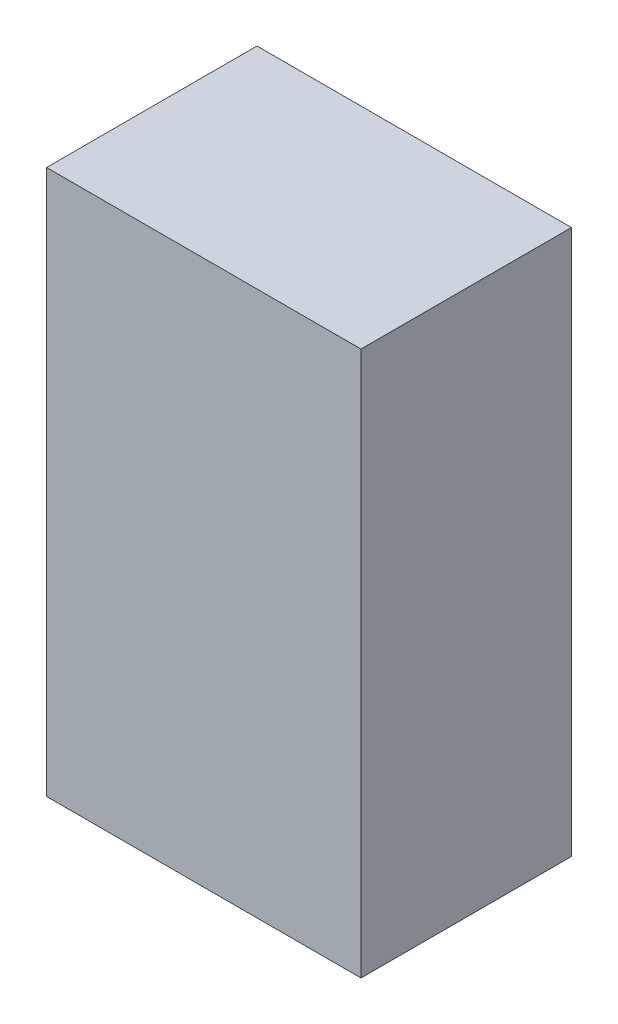
ISO-10303-21;
HEADER;
FILE_DESCRIPTION(('STEP AP214'),'2;1');
FILE_NAME('part.step','',(''),(''),'','','');
FILE_SCHEMA(('AUTOMOTIVE_DESIGN { 1 0 10303 214 1 1 1 1 }'));
ENDSEC;
DATA;
#1=APPLICATION_CONTEXT('core data for automotive mechanical design processes');
#2=APPLICATION_PROTOCOL_DEFINITION('international standard','automotive_design',2000,#1);
#3=PRODUCT_CONTEXT('',#1,'mechanical');
#4=PRODUCT('Part','Part','',(#3));
#5=PRODUCT_RELATED_PRODUCT_CATEGORY('part','',(#4));
#6=PRODUCT_DEFINITION_FORMATION('','',#4);
#7=PRODUCT_DEFINITION_CONTEXT('part definition',#1,'design');
#8=PRODUCT_DEFINITION('design','',#6,#7);
#9=PRODUCT_DEFINITION_SHAPE('','',#8);
#10=(LENGTH_UNIT() NAMED_UNIT(*) SI_UNIT(.MILLI.,.METRE.));
#11=(NAMED_UNIT(*) PLANE_ANGLE_UNIT() SI_UNIT($,.RADIAN.));
#12=(NAMED_UNIT(*) SI_UNIT($,.STERADIAN.) SOLID_ANGLE_UNIT());
#13=UNCERTAINTY_MEASURE_WITH_UNIT(LENGTH_MEASURE(1.E-05),#10,'distance_accuracy_value','');
#14=(GEOMETRIC_REPRESENTATION_CONTEXT(3) GLOBAL_UNCERTAINTY_ASSIGNED_CONTEXT((#13)) GLOBAL_UNIT_ASSIGNED_CONTEXT((#10,
#11,#12)) REPRESENTATION_CONTEXT('',''));
#15=CARTESIAN_POINT('',(0.,0.,0.));
#16=DIRECTION('',(0.,0.,1.));
#17=DIRECTION('',(1.,0.,0.));
#18=AXIS2_PLACEMENT_3D('',#15,#16,#17);
#19=CARTESIAN_POINT('',(-0.635,1.10000034,0.85000084));
#20=DIRECTION('',(0.,0.,1.));
#21=DIRECTION('',(1.,0.,0.));
#22=AXIS2_PLACEMENT_3D('',#19,#20,#21);
#23=PLANE('',#22);
#24=DIRECTION('',(0.,1.,0.));
#25=VECTOR('',#24,1.);
#26=CARTESIAN_POINT('',(0.635,1.10000034,0.85000084));
#27=LINE('',#26,#25);
#28=CARTESIAN_POINT('',(0.635,1.10000034,0.85000084));
#29=VERTEX_POINT('',#28);
#30=CARTESIAN_POINT('',(0.635,-1.10000034,0.85000084));
#31=VERTEX_POINT('',#30);
#32=EDGE_CURVE('E53',#29,#31,#27,.F.);
#33=ORIENTED_EDGE('',*,*,#32,.F.);
#34=DIRECTION('',(1.,0.,0.));
#35=VECTOR('',#34,1.);
#36=CARTESIAN_POINT('',(-0.635,1.10000034,0.85000084));
#37=LINE('',#36,#35);
#38=CARTESIAN_POINT('',(-0.635,1.10000034,0.85000084));
#39=VERTEX_POINT('',#38);
#40=EDGE_CURVE('E20',#29,#39,#37,.F.);
#41=ORIENTED_EDGE('',*,*,#40,.T.);
#42=DIRECTION('',(0.,1.,0.));
#43=VECTOR('',#42,1.);
#44=CARTESIAN_POINT('',(-0.635,-1.10000034,0.85000084));
#45=LINE('',#44,#43);
#46=CARTESIAN_POINT('',(-0.635,-1.10000034,0.85000084));
#47=VERTEX_POINT('',#46);
#48=EDGE_CURVE('E67',#47,#39,#45,.T.);
#49=ORIENTED_EDGE('',*,*,#48,.F.);
#50=DIRECTION('',(1.,0.,0.));
#51=VECTOR('',#50,1.);
#52=CARTESIAN_POINT('',(0.635,-1.10000034,0.85000084));
#53=LINE('',#52,#51);
#54=EDGE_CURVE('E58',#31,#47,#53,.F.);
#55=ORIENTED_EDGE('',*,*,#54,.F.);
#56=EDGE_LOOP('',(#33,#41,#49,#55));
#57=FACE_BOUND('',#56,.T.);
#58=ADVANCED_FACE('F17',(#57),#23,.T.);
#59=CARTESIAN_POINT('',(-0.635,-1.10000034,0.));
#60=DIRECTION('',(-1.,0.,0.));
#61=DIRECTION('',(0.,0.,1.));
#62=AXIS2_PLACEMENT_3D('',#59,#60,#61);
#63=PLANE('',#62);
#64=DIRECTION('',(0.,0.,1.));
#65=VECTOR('',#64,1.);
#66=CARTESIAN_POINT('',(-0.635,1.10000034,0.));
#67=LINE('',#66,#65);
#68=CARTESIAN_POINT('',(-0.635,1.10000034,0.));
#69=VERTEX_POINT('',#68);
#70=EDGE_CURVE('E80',#69,#39,#67,.T.);
#71=ORIENTED_EDGE('',*,*,#70,.F.);
#72=DIRECTION('',(0.,1.,0.));
#73=VECTOR('',#72,1.);
#74=CARTESIAN_POINT('',(-0.635,1.10000034,0.));
#75=LINE('',#74,#73);
#76=CARTESIAN_POINT('',(-0.635,-1.10000034,0.));
#77=VERTEX_POINT('',#76);
#78=EDGE_CURVE('E75',#69,#77,#75,.F.);
#79=ORIENTED_EDGE('',*,*,#78,.T.);
#80=DIRECTION('',(0.,0.,-1.));
#81=VECTOR('',#80,1.);
#82=CARTESIAN_POINT('',(-0.635,-1.10000034,0.));
#83=LINE('',#82,#81);
#84=EDGE_CURVE('E63',#47,#77,#83,.T.);
#85=ORIENTED_EDGE('',*,*,#84,.F.);
#86=ORIENTED_EDGE('',*,*,#48,.T.);
#87=EDGE_LOOP('',(#71,#79,#85,#86));
#88=FACE_BOUND('',#87,.T.);
#89=ADVANCED_FACE('F74',(#88),#63,.T.);
#90=CARTESIAN_POINT('',(0.635,-1.10000034,0.));
#91=DIRECTION('',(0.,-1.,0.));
#92=DIRECTION('',(0.,0.,-1.));
#93=AXIS2_PLACEMENT_3D('',#90,#91,#92);
#94=PLANE('',#93);
#95=ORIENTED_EDGE('',*,*,#84,.T.);
#96=DIRECTION('',(1.,0.,0.));
#97=VECTOR('',#96,1.);
#98=CARTESIAN_POINT('',(-0.635,-1.10000034,0.));
#99=LINE('',#98,#97);
#100=CARTESIAN_POINT('',(0.635,-1.10000034,0.));
#101=VERTEX_POINT('',#100);
#102=EDGE_CURVE('E84',#77,#101,#99,.T.);
#103=ORIENTED_EDGE('',*,*,#102,.T.);
#104=DIRECTION('',(0.,0.,-1.));
#105=VECTOR('',#104,1.);
#106=CARTESIAN_POINT('',(0.635,-1.10000034,0.));
#107=LINE('',#106,#105);
#108=EDGE_CURVE('E65',#31,#101,#107,.T.);
#109=ORIENTED_EDGE('',*,*,#108,.F.);
#110=ORIENTED_EDGE('',*,*,#54,.T.);
#111=EDGE_LOOP('',(#95,#103,#109,#110));
#112=FACE_BOUND('',#111,.T.);
#113=ADVANCED_FACE('F60',(#112),#94,.T.);
#114=CARTESIAN_POINT('',(0.635,1.10000034,0.));
#115=DIRECTION('',(1.,0.,0.));
#116=DIRECTION('',(0.,0.,-1.));
#117=AXIS2_PLACEMENT_3D('',#114,#115,#116);
#118=PLANE('',#117);
#119=ORIENTED_EDGE('',*,*,#108,.T.);
#120=DIRECTION('',(0.,1.,0.));
#121=VECTOR('',#120,1.);
#122=CARTESIAN_POINT('',(0.635,1.10000034,0.));
#123=LINE('',#122,#121);
#124=CARTESIAN_POINT('',(0.635,1.10000034,0.));
#125=VERTEX_POINT('',#124);
#126=EDGE_CURVE('E26',#101,#125,#123,.T.);
#127=ORIENTED_EDGE('',*,*,#126,.T.);
#128=DIRECTION('',(0.,0.,1.));
#129=VECTOR('',#128,1.);
#130=CARTESIAN_POINT('',(0.635,1.10000034,0.));
#131=LINE('',#130,#129);
#132=EDGE_CURVE('E34',#29,#125,#131,.F.);
#133=ORIENTED_EDGE('',*,*,#132,.F.);
#134=ORIENTED_EDGE('',*,*,#32,.T.);
#135=EDGE_LOOP('',(#119,#127,#133,#134));
#136=FACE_BOUND('',#135,.T.);
#137=ADVANCED_FACE('F88',(#136),#118,.T.);
#138=CARTESIAN_POINT('',(-0.635,1.10000034,0.));
#139=DIRECTION('',(0.,1.,0.));
#140=DIRECTION('',(0.,0.,1.));
#141=AXIS2_PLACEMENT_3D('',#138,#139,#140);
#142=PLANE('',#141);
#143=ORIENTED_EDGE('',*,*,#132,.T.);
#144=DIRECTION('',(1.,0.,0.));
#145=VECTOR('',#144,1.);
#146=CARTESIAN_POINT('',(-0.635,1.10000034,0.));
#147=LINE('',#146,#145);
#148=EDGE_CURVE('E11',#125,#69,#147,.F.);
#149=ORIENTED_EDGE('',*,*,#148,.T.);
#150=ORIENTED_EDGE('',*,*,#70,.T.);
#151=ORIENTED_EDGE('',*,*,#40,.F.);
#152=EDGE_LOOP('',(#143,#149,#150,#151));
#153=FACE_BOUND('',#152,.T.);
#154=ADVANCED_FACE('F91',(#153),#142,.T.);
#155=CARTESIAN_POINT('',(-0.635,1.10000034,0.));
#156=DIRECTION('',(0.,0.,1.));
#157=DIRECTION('',(1.,0.,0.));
#158=AXIS2_PLACEMENT_3D('',#155,#156,#157);
#159=PLANE('',#158);
#160=ORIENTED_EDGE('',*,*,#126,.F.);
#161=ORIENTED_EDGE('',*,*,#102,.F.);
#162=ORIENTED_EDGE('',*,*,#78,.F.);
#163=ORIENTED_EDGE('',*,*,#148,.F.);
#164=EDGE_LOOP('',(#160,#161,#162,#163));
#165=FACE_BOUND('',#164,.T.);
#166=ADVANCED_FACE('F90',(#165),#159,.F.);
#167=CLOSED_SHELL('',(#58,#89,#113,#137,#154,#166));
#168=MANIFOLD_SOLID_BREP('B1',#167);
#169=ADVANCED_BREP_SHAPE_REPRESENTATION('',(#18,#168),#14);
#170=SHAPE_DEFINITION_REPRESENTATION(#9,#169);
ENDSEC;
END-ISO-10303-21;
